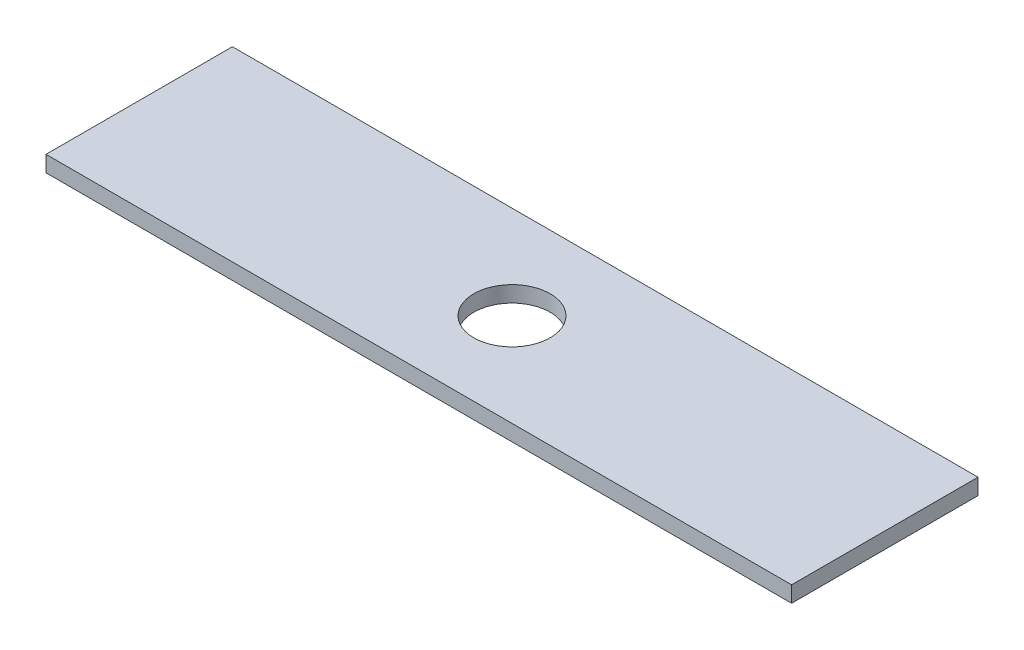
ISO-10303-21;
HEADER;
FILE_DESCRIPTION(('STEP AP214'),'2;1');
FILE_NAME('part.step','',(''),(''),'','','');
FILE_SCHEMA(('AUTOMOTIVE_DESIGN { 1 0 10303 214 1 1 1 1 }'));
ENDSEC;
DATA;
#1=APPLICATION_CONTEXT('core data for automotive mechanical design processes');
#2=APPLICATION_PROTOCOL_DEFINITION('international standard','automotive_design',2000,#1);
#3=PRODUCT_CONTEXT('',#1,'mechanical');
#4=PRODUCT('Part','Part','',(#3));
#5=PRODUCT_RELATED_PRODUCT_CATEGORY('part','',(#4));
#6=PRODUCT_DEFINITION_FORMATION('','',#4);
#7=PRODUCT_DEFINITION_CONTEXT('part definition',#1,'design');
#8=PRODUCT_DEFINITION('design','',#6,#7);
#9=PRODUCT_DEFINITION_SHAPE('','',#8);
#10=(LENGTH_UNIT() NAMED_UNIT(*) SI_UNIT(.MILLI.,.METRE.));
#11=(NAMED_UNIT(*) PLANE_ANGLE_UNIT() SI_UNIT($,.RADIAN.));
#12=(NAMED_UNIT(*) SI_UNIT($,.STERADIAN.) SOLID_ANGLE_UNIT());
#13=UNCERTAINTY_MEASURE_WITH_UNIT(LENGTH_MEASURE(1.E-05),#10,'distance_accuracy_value','');
#14=(GEOMETRIC_REPRESENTATION_CONTEXT(3) GLOBAL_UNCERTAINTY_ASSIGNED_CONTEXT((#13)) GLOBAL_UNIT_ASSIGNED_CONTEXT((#10,
#11,#12)) REPRESENTATION_CONTEXT('',''));
#15=CARTESIAN_POINT('',(0.,0.,0.));
#16=DIRECTION('',(0.,0.,1.));
#17=DIRECTION('',(1.,0.,0.));
#18=AXIS2_PLACEMENT_3D('',#15,#16,#17);
#19=CARTESIAN_POINT('',(50.,-1.075,-12.5));
#20=DIRECTION('',(1.,0.,0.));
#21=DIRECTION('',(0.,0.,-1.));
#22=AXIS2_PLACEMENT_3D('',#19,#20,#21);
#23=PLANE('',#22);
#24=DIRECTION('',(0.,1.,0.));
#25=VECTOR('',#24,1.);
#26=CARTESIAN_POINT('',(50.,-1.075,-12.5));
#27=LINE('',#26,#25);
#28=CARTESIAN_POINT('',(50.,-1.075,-12.5));
#29=VERTEX_POINT('',#28);
#30=CARTESIAN_POINT('',(50.,1.075,-12.5));
#31=VERTEX_POINT('',#30);
#32=EDGE_CURVE('E36',#29,#31,#27,.T.);
#33=ORIENTED_EDGE('',*,*,#32,.T.);
#34=DIRECTION('',(0.,0.,-1.));
#35=VECTOR('',#34,1.);
#36=CARTESIAN_POINT('',(50.,1.075,-12.5));
#37=LINE('',#36,#35);
#38=CARTESIAN_POINT('',(50.,1.075,12.5));
#39=VERTEX_POINT('',#38);
#40=EDGE_CURVE('E73',#39,#31,#37,.T.);
#41=ORIENTED_EDGE('',*,*,#40,.F.);
#42=DIRECTION('',(0.,1.,0.));
#43=VECTOR('',#42,1.);
#44=CARTESIAN_POINT('',(50.,-1.075,12.5));
#45=LINE('',#44,#43);
#46=CARTESIAN_POINT('',(50.,-1.075,12.5));
#47=VERTEX_POINT('',#46);
#48=EDGE_CURVE('E11',#47,#39,#45,.T.);
#49=ORIENTED_EDGE('',*,*,#48,.F.);
#50=DIRECTION('',(0.,0.,-1.));
#51=VECTOR('',#50,1.);
#52=CARTESIAN_POINT('',(50.,-1.075,-12.5));
#53=LINE('',#52,#51);
#54=EDGE_CURVE('E74',#47,#29,#53,.T.);
#55=ORIENTED_EDGE('',*,*,#54,.T.);
#56=EDGE_LOOP('',(#33,#41,#49,#55));
#57=FACE_BOUND('',#56,.T.);
#58=ADVANCED_FACE('F33',(#57),#23,.T.);
#59=CARTESIAN_POINT('',(-50.,-1.075,12.5));
#60=DIRECTION('',(0.,0.,1.));
#61=DIRECTION('',(1.,0.,0.));
#62=AXIS2_PLACEMENT_3D('',#59,#60,#61);
#63=PLANE('',#62);
#64=ORIENTED_EDGE('',*,*,#48,.T.);
#65=DIRECTION('',(1.,0.,0.));
#66=VECTOR('',#65,1.);
#67=CARTESIAN_POINT('',(-50.,1.075,12.5));
#68=LINE('',#67,#66);
#69=CARTESIAN_POINT('',(-50.,1.075,12.5));
#70=VERTEX_POINT('',#69);
#71=EDGE_CURVE('E90',#70,#39,#68,.T.);
#72=ORIENTED_EDGE('',*,*,#71,.F.);
#73=DIRECTION('',(0.,1.,0.));
#74=VECTOR('',#73,1.);
#75=CARTESIAN_POINT('',(-50.,-1.075,12.5));
#76=LINE('',#75,#74);
#77=CARTESIAN_POINT('',(-50.,-1.075,12.5));
#78=VERTEX_POINT('',#77);
#79=EDGE_CURVE('E41',#78,#70,#76,.T.);
#80=ORIENTED_EDGE('',*,*,#79,.F.);
#81=DIRECTION('',(1.,0.,0.));
#82=VECTOR('',#81,1.);
#83=CARTESIAN_POINT('',(-50.,-1.075,12.5));
#84=LINE('',#83,#82);
#85=EDGE_CURVE('E79',#78,#47,#84,.T.);
#86=ORIENTED_EDGE('',*,*,#85,.T.);
#87=EDGE_LOOP('',(#64,#72,#80,#86));
#88=FACE_BOUND('',#87,.T.);
#89=ADVANCED_FACE('F110',(#88),#63,.T.);
#90=CARTESIAN_POINT('',(-50.,-1.075,-12.5));
#91=DIRECTION('',(-1.,0.,0.));
#92=DIRECTION('',(0.,0.,1.));
#93=AXIS2_PLACEMENT_3D('',#90,#91,#92);
#94=PLANE('',#93);
#95=ORIENTED_EDGE('',*,*,#79,.T.);
#96=DIRECTION('',(0.,0.,1.));
#97=VECTOR('',#96,1.);
#98=CARTESIAN_POINT('',(-50.,1.075,-12.5));
#99=LINE('',#98,#97);
#100=CARTESIAN_POINT('',(-50.,1.075,-12.5));
#101=VERTEX_POINT('',#100);
#102=EDGE_CURVE('E86',#101,#70,#99,.T.);
#103=ORIENTED_EDGE('',*,*,#102,.F.);
#104=DIRECTION('',(0.,1.,0.));
#105=VECTOR('',#104,1.);
#106=CARTESIAN_POINT('',(-50.,-1.075,-12.5));
#107=LINE('',#106,#105);
#108=CARTESIAN_POINT('',(-50.,-1.075,-12.5));
#109=VERTEX_POINT('',#108);
#110=EDGE_CURVE('E78',#109,#101,#107,.T.);
#111=ORIENTED_EDGE('',*,*,#110,.F.);
#112=DIRECTION('',(0.,0.,1.));
#113=VECTOR('',#112,1.);
#114=CARTESIAN_POINT('',(-50.,-1.075,-12.5));
#115=LINE('',#114,#113);
#116=EDGE_CURVE('E103',#109,#78,#115,.T.);
#117=ORIENTED_EDGE('',*,*,#116,.T.);
#118=EDGE_LOOP('',(#95,#103,#111,#117));
#119=FACE_BOUND('',#118,.T.);
#120=ADVANCED_FACE('F107',(#119),#94,.T.);
#121=CARTESIAN_POINT('',(-50.,-1.075,-12.5));
#122=DIRECTION('',(0.,0.,-1.));
#123=DIRECTION('',(-1.,0.,0.));
#124=AXIS2_PLACEMENT_3D('',#121,#122,#123);
#125=PLANE('',#124);
#126=ORIENTED_EDGE('',*,*,#110,.T.);
#127=DIRECTION('',(-1.,0.,0.));
#128=VECTOR('',#127,1.);
#129=CARTESIAN_POINT('',(-50.,1.075,-12.5));
#130=LINE('',#129,#128);
#131=EDGE_CURVE('E81',#31,#101,#130,.T.);
#132=ORIENTED_EDGE('',*,*,#131,.F.);
#133=ORIENTED_EDGE('',*,*,#32,.F.);
#134=DIRECTION('',(-1.,0.,0.));
#135=VECTOR('',#134,1.);
#136=CARTESIAN_POINT('',(-50.,-1.075,-12.5));
#137=LINE('',#136,#135);
#138=EDGE_CURVE('E101',#29,#109,#137,.T.);
#139=ORIENTED_EDGE('',*,*,#138,.T.);
#140=EDGE_LOOP('',(#126,#132,#133,#139));
#141=FACE_BOUND('',#140,.T.);
#142=ADVANCED_FACE('F82',(#141),#125,.T.);
#143=CARTESIAN_POINT('',(0.,-1.075,0.));
#144=DIRECTION('',(0.,1.,0.));
#145=DIRECTION('',(0.,0.,1.));
#146=AXIS2_PLACEMENT_3D('',#143,#144,#145);
#147=PLANE('',#146);
#148=CARTESIAN_POINT('',(0.,-1.075,0.));
#149=DIRECTION('',(0.,1.,0.));
#150=DIRECTION('',(0.,0.,1.));
#151=AXIS2_PLACEMENT_3D('',#148,#149,#150);
#152=CIRCLE('',#151,5.12);
#153=CARTESIAN_POINT('',(0.,-1.075,5.12));
#154=VERTEX_POINT('',#153);
#155=EDGE_CURVE('E91',#154,#154,#152,.T.);
#156=ORIENTED_EDGE('',*,*,#155,.T.);
#157=EDGE_LOOP('',(#156));
#158=FACE_BOUND('',#157,.T.);
#159=ORIENTED_EDGE('',*,*,#54,.F.);
#160=ORIENTED_EDGE('',*,*,#85,.F.);
#161=ORIENTED_EDGE('',*,*,#116,.F.);
#162=ORIENTED_EDGE('',*,*,#138,.F.);
#163=EDGE_LOOP('',(#159,#160,#161,#162));
#164=FACE_BOUND('',#163,.T.);
#165=ADVANCED_FACE('F112',(#158,#164),#147,.F.);
#166=CARTESIAN_POINT('',(0.,1.075,0.));
#167=DIRECTION('',(0.,1.,0.));
#168=DIRECTION('',(0.,0.,1.));
#169=AXIS2_PLACEMENT_3D('',#166,#167,#168);
#170=PLANE('',#169);
#171=CARTESIAN_POINT('',(0.,1.075,0.));
#172=DIRECTION('',(0.,1.,0.));
#173=DIRECTION('',(0.,0.,1.));
#174=AXIS2_PLACEMENT_3D('',#171,#172,#173);
#175=CIRCLE('',#174,5.12);
#176=CARTESIAN_POINT('',(0.,1.075,5.12));
#177=VERTEX_POINT('',#176);
#178=EDGE_CURVE('E94',#177,#177,#175,.T.);
#179=ORIENTED_EDGE('',*,*,#178,.F.);
#180=EDGE_LOOP('',(#179));
#181=FACE_BOUND('',#180,.T.);
#182=ORIENTED_EDGE('',*,*,#40,.T.);
#183=ORIENTED_EDGE('',*,*,#131,.T.);
#184=ORIENTED_EDGE('',*,*,#102,.T.);
#185=ORIENTED_EDGE('',*,*,#71,.T.);
#186=EDGE_LOOP('',(#182,#183,#184,#185));
#187=FACE_BOUND('',#186,.T.);
#188=ADVANCED_FACE('F89',(#181,#187),#170,.T.);
#189=CARTESIAN_POINT('',(0.,-1.075,0.));
#190=DIRECTION('',(0.,1.,0.));
#191=DIRECTION('',(0.,0.,1.));
#192=AXIS2_PLACEMENT_3D('',#189,#190,#191);
#193=CYLINDRICAL_SURFACE('',#192,5.12);
#194=ORIENTED_EDGE('',*,*,#155,.F.);
#195=EDGE_LOOP('',(#194));
#196=FACE_BOUND('',#195,.T.);
#197=ORIENTED_EDGE('',*,*,#178,.T.);
#198=EDGE_LOOP('',(#197));
#199=FACE_BOUND('',#198,.T.);
#200=ADVANCED_FACE('F120',(#196,#199),#193,.F.);
#201=CLOSED_SHELL('',(#58,#89,#120,#142,#165,#188,#200));
#202=MANIFOLD_SOLID_BREP('B2',#201);
#203=ADVANCED_BREP_SHAPE_REPRESENTATION('',(#18,#202),#14);
#204=SHAPE_DEFINITION_REPRESENTATION(#9,#203);
ENDSEC;
END-ISO-10303-21;
